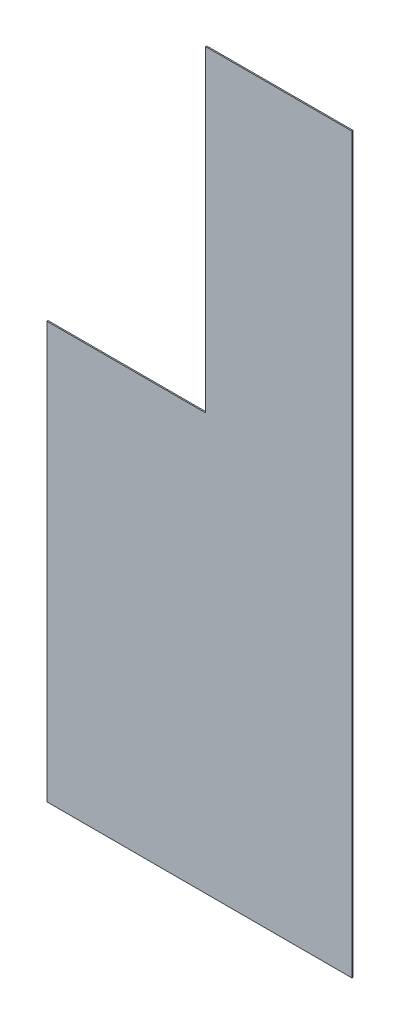
ISO-10303-21;
HEADER;
FILE_DESCRIPTION(('STEP AP214'),'2;1');
FILE_NAME('part.step','',(''),(''),'','','');
FILE_SCHEMA(('AUTOMOTIVE_DESIGN { 1 0 10303 214 1 1 1 1 }'));
ENDSEC;
DATA;
#1=APPLICATION_CONTEXT('core data for automotive mechanical design processes');
#2=APPLICATION_PROTOCOL_DEFINITION('international standard','automotive_design',2000,#1);
#3=PRODUCT_CONTEXT('',#1,'mechanical');
#4=PRODUCT('Part','Part','',(#3));
#5=PRODUCT_RELATED_PRODUCT_CATEGORY('part','',(#4));
#6=PRODUCT_DEFINITION_FORMATION('','',#4);
#7=PRODUCT_DEFINITION_CONTEXT('part definition',#1,'design');
#8=PRODUCT_DEFINITION('design','',#6,#7);
#9=PRODUCT_DEFINITION_SHAPE('','',#8);
#10=(LENGTH_UNIT() NAMED_UNIT(*) SI_UNIT(.MILLI.,.METRE.));
#11=(NAMED_UNIT(*) PLANE_ANGLE_UNIT() SI_UNIT($,.RADIAN.));
#12=(NAMED_UNIT(*) SI_UNIT($,.STERADIAN.) SOLID_ANGLE_UNIT());
#13=UNCERTAINTY_MEASURE_WITH_UNIT(LENGTH_MEASURE(1.E-05),#10,'distance_accuracy_value','');
#14=(GEOMETRIC_REPRESENTATION_CONTEXT(3) GLOBAL_UNCERTAINTY_ASSIGNED_CONTEXT((#13)) GLOBAL_UNIT_ASSIGNED_CONTEXT((#10,
#11,#12)) REPRESENTATION_CONTEXT('',''));
#15=CARTESIAN_POINT('',(0.,0.,0.));
#16=DIRECTION('',(0.,0.,1.));
#17=DIRECTION('',(1.,0.,0.));
#18=AXIS2_PLACEMENT_3D('',#15,#16,#17);
#19=CARTESIAN_POINT('',(2506.,-1.56228099154865E-12,-10.));
#20=DIRECTION('',(0.,-1.,0.));
#21=DIRECTION('',(1.,0.,0.));
#22=AXIS2_PLACEMENT_3D('',#19,#20,#21);
#23=PLANE('',#22);
#24=DIRECTION('',(1.,0.,0.));
#25=VECTOR('',#24,1.);
#26=CARTESIAN_POINT('',(2506.,-1.56228099154865E-12,0.));
#27=LINE('',#26,#25);
#28=CARTESIAN_POINT('',(0.,0.,0.));
#29=VERTEX_POINT('',#28);
#30=CARTESIAN_POINT('',(2506.,-1.56228099154865E-12,0.));
#31=VERTEX_POINT('',#30);
#32=EDGE_CURVE('E123',#29,#31,#27,.T.);
#33=ORIENTED_EDGE('',*,*,#32,.F.);
#34=DIRECTION('',(0.,0.,1.));
#35=VECTOR('',#34,1.);
#36=CARTESIAN_POINT('',(0.,0.,-10.));
#37=LINE('',#36,#35);
#38=CARTESIAN_POINT('',(0.,0.,-10.));
#39=VERTEX_POINT('',#38);
#40=EDGE_CURVE('E11',#39,#29,#37,.T.);
#41=ORIENTED_EDGE('',*,*,#40,.F.);
#42=DIRECTION('',(1.,0.,0.));
#43=VECTOR('',#42,1.);
#44=CARTESIAN_POINT('',(2506.,-1.56228099154865E-12,-10.));
#45=LINE('',#44,#43);
#46=CARTESIAN_POINT('',(2506.,-1.56228099154865E-12,-10.));
#47=VERTEX_POINT('',#46);
#48=EDGE_CURVE('E137',#39,#47,#45,.T.);
#49=ORIENTED_EDGE('',*,*,#48,.T.);
#50=DIRECTION('',(0.,0.,1.));
#51=VECTOR('',#50,1.);
#52=CARTESIAN_POINT('',(2506.,-1.56228099154865E-12,-10.));
#53=LINE('',#52,#51);
#54=EDGE_CURVE('E41',#47,#31,#53,.T.);
#55=ORIENTED_EDGE('',*,*,#54,.T.);
#56=EDGE_LOOP('',(#33,#41,#49,#55));
#57=FACE_BOUND('',#56,.T.);
#58=ADVANCED_FACE('F38',(#57),#23,.T.);
#59=CARTESIAN_POINT('',(0.,0.,-10.));
#60=DIRECTION('',(-1.,0.,0.));
#61=DIRECTION('',(0.,0.,1.));
#62=AXIS2_PLACEMENT_3D('',#59,#60,#61);
#63=PLANE('',#62);
#64=DIRECTION('',(0.,-1.,0.));
#65=VECTOR('',#64,1.);
#66=CARTESIAN_POINT('',(0.,0.,0.));
#67=LINE('',#66,#65);
#68=CARTESIAN_POINT('',(0.,3417.,0.));
#69=VERTEX_POINT('',#68);
#70=EDGE_CURVE('E135',#69,#29,#67,.T.);
#71=ORIENTED_EDGE('',*,*,#70,.F.);
#72=DIRECTION('',(0.,0.,1.));
#73=VECTOR('',#72,1.);
#74=CARTESIAN_POINT('',(0.,3417.,-10.));
#75=LINE('',#74,#73);
#76=CARTESIAN_POINT('',(0.,3417.,-10.));
#77=VERTEX_POINT('',#76);
#78=EDGE_CURVE('E47',#77,#69,#75,.T.);
#79=ORIENTED_EDGE('',*,*,#78,.F.);
#80=DIRECTION('',(0.,-1.,0.));
#81=VECTOR('',#80,1.);
#82=CARTESIAN_POINT('',(0.,0.,-10.));
#83=LINE('',#82,#81);
#84=EDGE_CURVE('E113',#77,#39,#83,.T.);
#85=ORIENTED_EDGE('',*,*,#84,.T.);
#86=ORIENTED_EDGE('',*,*,#40,.T.);
#87=EDGE_LOOP('',(#71,#79,#85,#86));
#88=FACE_BOUND('',#87,.T.);
#89=ADVANCED_FACE('F145',(#88),#63,.T.);
#90=CARTESIAN_POINT('',(0.,3417.,-10.));
#91=DIRECTION('',(0.,1.,0.));
#92=DIRECTION('',(0.,0.,1.));
#93=AXIS2_PLACEMENT_3D('',#90,#91,#92);
#94=PLANE('',#93);
#95=DIRECTION('',(-1.,0.,0.));
#96=VECTOR('',#95,1.);
#97=CARTESIAN_POINT('',(0.,3417.,0.));
#98=LINE('',#97,#96);
#99=CARTESIAN_POINT('',(1305.,3417.,0.));
#100=VERTEX_POINT('',#99);
#101=EDGE_CURVE('E100',#100,#69,#98,.T.);
#102=ORIENTED_EDGE('',*,*,#101,.F.);
#103=DIRECTION('',(0.,0.,1.));
#104=VECTOR('',#103,1.);
#105=CARTESIAN_POINT('',(1305.,3417.,-10.));
#106=LINE('',#105,#104);
#107=CARTESIAN_POINT('',(1305.,3417.,-10.));
#108=VERTEX_POINT('',#107);
#109=EDGE_CURVE('E95',#108,#100,#106,.T.);
#110=ORIENTED_EDGE('',*,*,#109,.F.);
#111=DIRECTION('',(-1.,0.,0.));
#112=VECTOR('',#111,1.);
#113=CARTESIAN_POINT('',(0.,3417.,-10.));
#114=LINE('',#113,#112);
#115=EDGE_CURVE('E98',#108,#77,#114,.T.);
#116=ORIENTED_EDGE('',*,*,#115,.T.);
#117=ORIENTED_EDGE('',*,*,#78,.T.);
#118=EDGE_LOOP('',(#102,#110,#116,#117));
#119=FACE_BOUND('',#118,.T.);
#120=ADVANCED_FACE('F97',(#119),#94,.T.);
#121=CARTESIAN_POINT('',(1305.,3417.,-10.));
#122=DIRECTION('',(-1.,0.,0.));
#123=DIRECTION('',(0.,0.,1.));
#124=AXIS2_PLACEMENT_3D('',#121,#122,#123);
#125=PLANE('',#124);
#126=DIRECTION('',(0.,-1.,0.));
#127=VECTOR('',#126,1.);
#128=CARTESIAN_POINT('',(1305.,3417.,0.));
#129=LINE('',#128,#127);
#130=CARTESIAN_POINT('',(1305.,6021.,0.));
#131=VERTEX_POINT('',#130);
#132=EDGE_CURVE('E132',#131,#100,#129,.T.);
#133=ORIENTED_EDGE('',*,*,#132,.F.);
#134=DIRECTION('',(0.,0.,1.));
#135=VECTOR('',#134,1.);
#136=CARTESIAN_POINT('',(1305.,6021.,-10.));
#137=LINE('',#136,#135);
#138=CARTESIAN_POINT('',(1305.,6021.,-10.));
#139=VERTEX_POINT('',#138);
#140=EDGE_CURVE('E105',#139,#131,#137,.T.);
#141=ORIENTED_EDGE('',*,*,#140,.F.);
#142=DIRECTION('',(0.,-1.,0.));
#143=VECTOR('',#142,1.);
#144=CARTESIAN_POINT('',(1305.,3417.,-10.));
#145=LINE('',#144,#143);
#146=EDGE_CURVE('E111',#139,#108,#145,.T.);
#147=ORIENTED_EDGE('',*,*,#146,.T.);
#148=ORIENTED_EDGE('',*,*,#109,.T.);
#149=EDGE_LOOP('',(#133,#141,#147,#148));
#150=FACE_BOUND('',#149,.T.);
#151=ADVANCED_FACE('F115',(#150),#125,.T.);
#152=CARTESIAN_POINT('',(1305.,6021.,-10.));
#153=DIRECTION('',(0.,1.,0.));
#154=DIRECTION('',(0.,0.,1.));
#155=AXIS2_PLACEMENT_3D('',#152,#153,#154);
#156=PLANE('',#155);
#157=DIRECTION('',(-1.,0.,0.));
#158=VECTOR('',#157,1.);
#159=CARTESIAN_POINT('',(1305.,6021.,0.));
#160=LINE('',#159,#158);
#161=CARTESIAN_POINT('',(2506.,6021.,0.));
#162=VERTEX_POINT('',#161);
#163=EDGE_CURVE('E129',#162,#131,#160,.T.);
#164=ORIENTED_EDGE('',*,*,#163,.F.);
#165=DIRECTION('',(0.,0.,1.));
#166=VECTOR('',#165,1.);
#167=CARTESIAN_POINT('',(2506.,6021.,-10.));
#168=LINE('',#167,#166);
#169=CARTESIAN_POINT('',(2506.,6021.,-10.));
#170=VERTEX_POINT('',#169);
#171=EDGE_CURVE('E140',#170,#162,#168,.T.);
#172=ORIENTED_EDGE('',*,*,#171,.F.);
#173=DIRECTION('',(-1.,0.,0.));
#174=VECTOR('',#173,1.);
#175=CARTESIAN_POINT('',(1305.,6021.,-10.));
#176=LINE('',#175,#174);
#177=EDGE_CURVE('E116',#170,#139,#176,.T.);
#178=ORIENTED_EDGE('',*,*,#177,.T.);
#179=ORIENTED_EDGE('',*,*,#140,.T.);
#180=EDGE_LOOP('',(#164,#172,#178,#179));
#181=FACE_BOUND('',#180,.T.);
#182=ADVANCED_FACE('F158',(#181),#156,.T.);
#183=CARTESIAN_POINT('',(2506.,6021.,-10.));
#184=DIRECTION('',(1.,0.,0.));
#185=DIRECTION('',(0.,1.,0.));
#186=AXIS2_PLACEMENT_3D('',#183,#184,#185);
#187=PLANE('',#186);
#188=DIRECTION('',(0.,1.,0.));
#189=VECTOR('',#188,1.);
#190=CARTESIAN_POINT('',(2506.,6021.,0.));
#191=LINE('',#190,#189);
#192=EDGE_CURVE('E126',#31,#162,#191,.T.);
#193=ORIENTED_EDGE('',*,*,#192,.F.);
#194=ORIENTED_EDGE('',*,*,#54,.F.);
#195=DIRECTION('',(0.,1.,0.));
#196=VECTOR('',#195,1.);
#197=CARTESIAN_POINT('',(2506.,6021.,-10.));
#198=LINE('',#197,#196);
#199=EDGE_CURVE('E118',#47,#170,#198,.T.);
#200=ORIENTED_EDGE('',*,*,#199,.T.);
#201=ORIENTED_EDGE('',*,*,#171,.T.);
#202=EDGE_LOOP('',(#193,#194,#200,#201));
#203=FACE_BOUND('',#202,.T.);
#204=ADVANCED_FACE('F142',(#203),#187,.T.);
#205=CARTESIAN_POINT('',(0.,0.,-10.));
#206=DIRECTION('',(0.,0.,-1.));
#207=DIRECTION('',(-1.,0.,0.));
#208=AXIS2_PLACEMENT_3D('',#205,#206,#207);
#209=PLANE('',#208);
#210=ORIENTED_EDGE('',*,*,#48,.F.);
#211=ORIENTED_EDGE('',*,*,#84,.F.);
#212=ORIENTED_EDGE('',*,*,#115,.F.);
#213=ORIENTED_EDGE('',*,*,#146,.F.);
#214=ORIENTED_EDGE('',*,*,#177,.F.);
#215=ORIENTED_EDGE('',*,*,#199,.F.);
#216=EDGE_LOOP('',(#210,#211,#212,#213,#214,#215));
#217=FACE_BOUND('',#216,.T.);
#218=ADVANCED_FACE('F109',(#217),#209,.T.);
#219=CARTESIAN_POINT('',(0.,0.,0.));
#220=DIRECTION('',(0.,0.,-1.));
#221=DIRECTION('',(-1.,0.,0.));
#222=AXIS2_PLACEMENT_3D('',#219,#220,#221);
#223=PLANE('',#222);
#224=ORIENTED_EDGE('',*,*,#32,.T.);
#225=ORIENTED_EDGE('',*,*,#192,.T.);
#226=ORIENTED_EDGE('',*,*,#163,.T.);
#227=ORIENTED_EDGE('',*,*,#132,.T.);
#228=ORIENTED_EDGE('',*,*,#101,.T.);
#229=ORIENTED_EDGE('',*,*,#70,.T.);
#230=EDGE_LOOP('',(#224,#225,#226,#227,#228,#229));
#231=FACE_BOUND('',#230,.T.);
#232=ADVANCED_FACE('F144',(#231),#223,.F.);
#233=CLOSED_SHELL('',(#58,#89,#120,#151,#182,#204,#218,#232));
#234=MANIFOLD_SOLID_BREP('B2',#233);
#235=ADVANCED_BREP_SHAPE_REPRESENTATION('',(#18,#234),#14);
#236=SHAPE_DEFINITION_REPRESENTATION(#9,#235);
ENDSEC;
END-ISO-10303-21;
